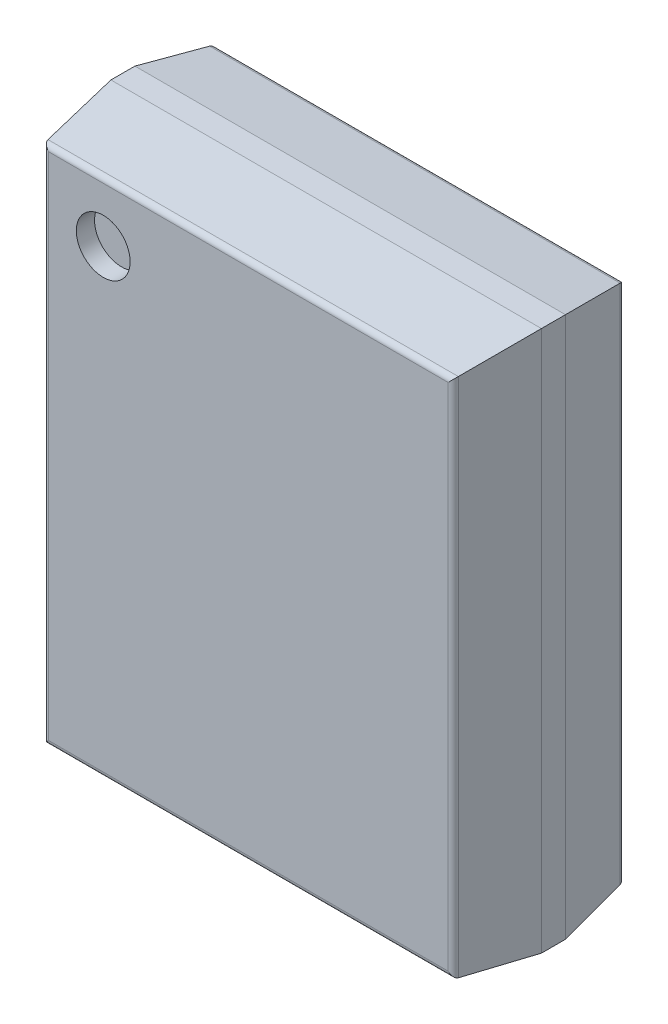
ISO-10303-21;
HEADER;
FILE_DESCRIPTION(('STEP AP214'),'2;1');
FILE_NAME('part.step','',(''),(''),'','','');
FILE_SCHEMA(('AUTOMOTIVE_DESIGN { 1 0 10303 214 1 1 1 1 }'));
ENDSEC;
DATA;
#1=APPLICATION_CONTEXT('core data for automotive mechanical design processes');
#2=APPLICATION_PROTOCOL_DEFINITION('international standard','automotive_design',2000,#1);
#3=PRODUCT_CONTEXT('',#1,'mechanical');
#4=PRODUCT('Part','Part','',(#3));
#5=PRODUCT_RELATED_PRODUCT_CATEGORY('part','',(#4));
#6=PRODUCT_DEFINITION_FORMATION('','',#4);
#7=PRODUCT_DEFINITION_CONTEXT('part definition',#1,'design');
#8=PRODUCT_DEFINITION('design','',#6,#7);
#9=PRODUCT_DEFINITION_SHAPE('','',#8);
#10=(LENGTH_UNIT() NAMED_UNIT(*) SI_UNIT(.MILLI.,.METRE.));
#11=(NAMED_UNIT(*) PLANE_ANGLE_UNIT() SI_UNIT($,.RADIAN.));
#12=(NAMED_UNIT(*) SI_UNIT($,.STERADIAN.) SOLID_ANGLE_UNIT());
#13=UNCERTAINTY_MEASURE_WITH_UNIT(LENGTH_MEASURE(1.E-05),#10,'distance_accuracy_value','');
#14=(GEOMETRIC_REPRESENTATION_CONTEXT(3) GLOBAL_UNCERTAINTY_ASSIGNED_CONTEXT((#13)) GLOBAL_UNIT_ASSIGNED_CONTEXT((#10,
#11,#12)) REPRESENTATION_CONTEXT('',''));
#15=CARTESIAN_POINT('',(0.,0.,0.));
#16=DIRECTION('',(0.,0.,1.));
#17=DIRECTION('',(1.,0.,0.));
#18=AXIS2_PLACEMENT_3D('',#15,#16,#17);
#19=CARTESIAN_POINT('',(-1.315,1.815,1.485));
#20=DIRECTION('',(0.,0.,1.));
#21=DIRECTION('',(1.,0.,0.));
#22=AXIS2_PLACEMENT_3D('',#19,#20,#21);
#23=PLANE('',#22);
#24=CARTESIAN_POINT('',(-1.315,1.815,1.485));
#25=DIRECTION('',(0.,0.,1.));
#26=DIRECTION('',(1.,0.,0.));
#27=AXIS2_PLACEMENT_3D('',#24,#25,#26);
#28=CIRCLE('',#27,0.24375);
#29=CARTESIAN_POINT('',(-1.07125,1.815,1.485));
#30=VERTEX_POINT('',#29);
#31=EDGE_CURVE('E11',#30,#30,#28,.T.);
#32=ORIENTED_EDGE('',*,*,#31,.T.);
#33=EDGE_LOOP('',(#32));
#34=FACE_BOUND('',#33,.T.);
#35=ADVANCED_FACE('F17',(#34),#23,.T.);
#36=CARTESIAN_POINT('',(-1.315,1.815,1.485));
#37=DIRECTION('',(0.,0.,1.));
#38=DIRECTION('',(1.,0.,0.));
#39=AXIS2_PLACEMENT_3D('',#36,#37,#38);
#40=CYLINDRICAL_SURFACE('',#39,0.24375);
#41=DIRECTION('',(0.,0.,1.));
#42=VECTOR('',#41,1.);
#43=CARTESIAN_POINT('',(-1.07125,1.815,1.485));
#44=LINE('',#43,#42);
#45=CARTESIAN_POINT('',(-1.07125,1.815,1.65));
#46=VERTEX_POINT('',#45);
#47=EDGE_CURVE('E20',#30,#46,#44,.T.);
#48=ORIENTED_EDGE('',*,*,#47,.T.);
#49=CARTESIAN_POINT('',(-1.315,1.815,1.65));
#50=DIRECTION('',(0.,0.,1.));
#51=DIRECTION('',(1.,0.,0.));
#52=AXIS2_PLACEMENT_3D('',#49,#50,#51);
#53=CIRCLE('',#52,0.24375);
#54=EDGE_CURVE('E200',#46,#46,#53,.T.);
#55=ORIENTED_EDGE('',*,*,#54,.T.);
#56=ORIENTED_EDGE('',*,*,#47,.F.);
#57=ORIENTED_EDGE('',*,*,#31,.F.);
#58=EDGE_LOOP('',(#48,#55,#56,#57));
#59=FACE_BOUND('',#58,.T.);
#60=ADVANCED_FACE('F468',(#59),#40,.F.);
#61=CARTESIAN_POINT('',(1.808944484583,-2.3525,1.6));
#62=DIRECTION('',(0.,1.,0.));
#63=DIRECTION('',(0.,0.,1.));
#64=AXIS2_PLACEMENT_3D('',#61,#62,#63);
#65=CYLINDRICAL_SURFACE('',#64,0.05);
#66=CARTESIAN_POINT('',(1.808944484583,-2.308944484583,1.6));
#67=DIRECTION('',(-0.707106781186548,-0.707106781186548,0.));
#68=DIRECTION('',(0.707106781186548,-0.707106781186548,0.));
#69=AXIS2_PLACEMENT_3D('',#66,#67,#68);
#70=ELLIPSE('',#69,0.07071067811865,0.05);
#71=CARTESIAN_POINT('',(1.85847222397,-2.35847222397,1.606855875671));
#72=VERTEX_POINT('',#71);
#73=CARTESIAN_POINT('',(1.808944484583,-2.308944484583,1.65));
#74=VERTEX_POINT('',#73);
#75=EDGE_CURVE('E298',#72,#74,#70,.T.);
#76=ORIENTED_EDGE('',*,*,#75,.F.);
#77=DIRECTION('',(0.,1.,0.));
#78=VECTOR('',#77,1.);
#79=CARTESIAN_POINT('',(1.85847222397,-2.3525,1.606855875671));
#80=LINE('',#79,#78);
#81=CARTESIAN_POINT('',(1.85847222397,2.35847222397,1.606855875671));
#82=VERTEX_POINT('',#81);
#83=EDGE_CURVE('E294',#72,#82,#80,.T.);
#84=ORIENTED_EDGE('',*,*,#83,.T.);
#85=CARTESIAN_POINT('',(1.808944484583,2.308944484583,1.6));
#86=DIRECTION('',(-0.707106781186548,0.707106781186548,0.));
#87=DIRECTION('',(0.707106781186548,0.707106781186548,0.));
#88=AXIS2_PLACEMENT_3D('',#85,#86,#87);
#89=ELLIPSE('',#88,0.07071067811865,0.05);
#90=CARTESIAN_POINT('',(1.808944484583,2.308944484583,1.65));
#91=VERTEX_POINT('',#90);
#92=EDGE_CURVE('E203',#91,#82,#89,.T.);
#93=ORIENTED_EDGE('',*,*,#92,.F.);
#94=DIRECTION('',(0.,1.,0.));
#95=VECTOR('',#94,1.);
#96=CARTESIAN_POINT('',(1.808944484583,-2.3525,1.65));
#97=LINE('',#96,#95);
#98=EDGE_CURVE('E306',#74,#91,#97,.T.);
#99=ORIENTED_EDGE('',*,*,#98,.F.);
#100=EDGE_LOOP('',(#76,#84,#93,#99));
#101=FACE_BOUND('',#100,.T.);
#102=ADVANCED_FACE('F320',(#101),#65,.T.);
#103=CARTESIAN_POINT('',(-1.8525,2.308944484583,1.6));
#104=DIRECTION('',(1.,0.,0.));
#105=DIRECTION('',(0.,0.,1.));
#106=AXIS2_PLACEMENT_3D('',#103,#104,#105);
#107=CYLINDRICAL_SURFACE('',#106,0.05);
#108=DIRECTION('',(1.,0.,0.));
#109=VECTOR('',#108,1.);
#110=CARTESIAN_POINT('',(-1.8525,2.308944484583,1.65));
#111=LINE('',#110,#109);
#112=CARTESIAN_POINT('',(-1.808944484583,2.308944484583,1.65));
#113=VERTEX_POINT('',#112);
#114=EDGE_CURVE('E204',#113,#91,#111,.T.);
#115=ORIENTED_EDGE('',*,*,#114,.T.);
#116=ORIENTED_EDGE('',*,*,#92,.T.);
#117=DIRECTION('',(1.,0.,0.));
#118=VECTOR('',#117,1.);
#119=CARTESIAN_POINT('',(-1.8525,2.35847222397,1.606855875671));
#120=LINE('',#119,#118);
#121=CARTESIAN_POINT('',(-1.85847222397,2.35847222397,1.606855875671));
#122=VERTEX_POINT('',#121);
#123=EDGE_CURVE('E289',#122,#82,#120,.T.);
#124=ORIENTED_EDGE('',*,*,#123,.F.);
#125=CARTESIAN_POINT('',(-1.808944484583,2.308944484583,1.6));
#126=DIRECTION('',(0.707106781186548,0.707106781186548,0.));
#127=DIRECTION('',(-0.707106781186548,0.707106781186548,0.));
#128=AXIS2_PLACEMENT_3D('',#125,#126,#127);
#129=ELLIPSE('',#128,0.07071067811865,0.05);
#130=EDGE_CURVE('E284',#122,#113,#129,.T.);
#131=ORIENTED_EDGE('',*,*,#130,.T.);
#132=EDGE_LOOP('',(#115,#116,#124,#131));
#133=FACE_BOUND('',#132,.T.);
#134=ADVANCED_FACE('F314',(#133),#107,.T.);
#135=CARTESIAN_POINT('',(-1.95,-2.45,1.65));
#136=DIRECTION('',(0.,0.,1.));
#137=DIRECTION('',(1.,0.,0.));
#138=AXIS2_PLACEMENT_3D('',#135,#136,#137);
#139=PLANE('',#138);
#140=ORIENTED_EDGE('',*,*,#54,.F.);
#141=EDGE_LOOP('',(#140));
#142=FACE_BOUND('',#141,.T.);
#143=DIRECTION('',(0.,1.,0.));
#144=VECTOR('',#143,1.);
#145=CARTESIAN_POINT('',(-1.808944484583,-2.3525,1.65));
#146=LINE('',#145,#144);
#147=CARTESIAN_POINT('',(-1.808944484583,-2.308944484583,1.65));
#148=VERTEX_POINT('',#147);
#149=EDGE_CURVE('E281',#148,#113,#146,.T.);
#150=ORIENTED_EDGE('',*,*,#149,.F.);
#151=DIRECTION('',(1.,0.,0.));
#152=VECTOR('',#151,1.);
#153=CARTESIAN_POINT('',(-1.8525,-2.308944484583,1.65));
#154=LINE('',#153,#152);
#155=EDGE_CURVE('E302',#148,#74,#154,.T.);
#156=ORIENTED_EDGE('',*,*,#155,.T.);
#157=ORIENTED_EDGE('',*,*,#98,.T.);
#158=ORIENTED_EDGE('',*,*,#114,.F.);
#159=EDGE_LOOP('',(#150,#156,#157,#158));
#160=FACE_BOUND('',#159,.T.);
#161=ADVANCED_FACE('F318',(#142,#160),#139,.T.);
#162=CARTESIAN_POINT('',(-1.8525,-2.308944484583,1.6));
#163=DIRECTION('',(1.,0.,0.));
#164=DIRECTION('',(0.,-0.990554787738321,0.137117513428044));
#165=AXIS2_PLACEMENT_3D('',#162,#163,#164);
#166=CYLINDRICAL_SURFACE('',#165,0.05);
#167=DIRECTION('',(1.,0.,0.));
#168=VECTOR('',#167,1.);
#169=CARTESIAN_POINT('',(-1.8525,-2.35847222397,1.606855875671));
#170=LINE('',#169,#168);
#171=CARTESIAN_POINT('',(-1.85847222397,-2.35847222397,1.606855875671));
#172=VERTEX_POINT('',#171);
#173=EDGE_CURVE('E226',#172,#72,#170,.T.);
#174=ORIENTED_EDGE('',*,*,#173,.T.);
#175=ORIENTED_EDGE('',*,*,#75,.T.);
#176=ORIENTED_EDGE('',*,*,#155,.F.);
#177=CARTESIAN_POINT('',(-1.808944484583,-2.308944484583,1.6));
#178=DIRECTION('',(-0.707106781186548,0.707106781186548,0.));
#179=DIRECTION('',(0.707106781186548,0.707106781186548,0.));
#180=AXIS2_PLACEMENT_3D('',#177,#178,#179);
#181=ELLIPSE('',#180,0.07071067811865,0.05);
#182=EDGE_CURVE('E230',#172,#148,#181,.T.);
#183=ORIENTED_EDGE('',*,*,#182,.F.);
#184=EDGE_LOOP('',(#174,#175,#176,#183));
#185=FACE_BOUND('',#184,.T.);
#186=ADVANCED_FACE('F329',(#185),#166,.T.);
#187=CARTESIAN_POINT('',(1.90125,-2.45,1.297823646339));
#188=DIRECTION('',(0.990554787738321,0.,0.137117513428044));
#189=DIRECTION('',(0.,-1.,0.));
#190=AXIS2_PLACEMENT_3D('',#187,#188,#189);
#191=PLANE('',#190);
#192=DIRECTION('',(-0.135846421408054,0.135846421408054,0.98137225331739));
#193=VECTOR('',#192,1.);
#194=CARTESIAN_POINT('',(1.86616385679,-2.36616385679,1.551290517721));
#195=LINE('',#194,#193);
#196=CARTESIAN_POINT('',(1.95,-2.45,0.945647292679));
#197=VERTEX_POINT('',#196);
#198=EDGE_CURVE('E231',#197,#72,#195,.T.);
#199=ORIENTED_EDGE('',*,*,#198,.F.);
#200=DIRECTION('',(0.,1.,0.));
#201=VECTOR('',#200,1.);
#202=CARTESIAN_POINT('',(1.95,-2.45,0.945647292679));
#203=LINE('',#202,#201);
#204=CARTESIAN_POINT('',(1.95,2.45,0.945647292679));
#205=VERTEX_POINT('',#204);
#206=EDGE_CURVE('E154',#197,#205,#203,.T.);
#207=ORIENTED_EDGE('',*,*,#206,.T.);
#208=DIRECTION('',(-0.135846421408054,-0.135846421408054,0.98137225331739));
#209=VECTOR('',#208,1.);
#210=CARTESIAN_POINT('',(1.820950943777,2.320950943777,1.877914493992));
#211=LINE('',#210,#209);
#212=EDGE_CURVE('E148',#205,#82,#211,.T.);
#213=ORIENTED_EDGE('',*,*,#212,.T.);
#214=ORIENTED_EDGE('',*,*,#83,.F.);
#215=EDGE_LOOP('',(#199,#207,#213,#214));
#216=FACE_BOUND('',#215,.T.);
#217=ADVANCED_FACE('F323',(#216),#191,.T.);
#218=CARTESIAN_POINT('',(-1.95,2.40125,1.297823646339));
#219=DIRECTION('',(0.,0.990554787738321,0.137117513428044));
#220=DIRECTION('',(1.,0.,0.));
#221=AXIS2_PLACEMENT_3D('',#218,#219,#220);
#222=PLANE('',#221);
#223=ORIENTED_EDGE('',*,*,#123,.T.);
#224=ORIENTED_EDGE('',*,*,#212,.F.);
#225=DIRECTION('',(1.,0.,0.));
#226=VECTOR('',#225,1.);
#227=CARTESIAN_POINT('',(-1.95,2.45,0.945647292679));
#228=LINE('',#227,#226);
#229=CARTESIAN_POINT('',(-1.95,2.45,0.945647292679));
#230=VERTEX_POINT('',#229);
#231=EDGE_CURVE('E141',#230,#205,#228,.T.);
#232=ORIENTED_EDGE('',*,*,#231,.F.);
#233=DIRECTION('',(0.135846421408054,-0.135846421408054,0.98137225331739));
#234=VECTOR('',#233,1.);
#235=CARTESIAN_POINT('',(-1.856936731685,2.356936731685,1.617948472062));
#236=LINE('',#235,#234);
#237=EDGE_CURVE('E145',#230,#122,#236,.T.);
#238=ORIENTED_EDGE('',*,*,#237,.T.);
#239=EDGE_LOOP('',(#223,#224,#232,#238));
#240=FACE_BOUND('',#239,.T.);
#241=ADVANCED_FACE('F144',(#240),#222,.T.);
#242=CARTESIAN_POINT('',(-1.808944484583,-2.3525,1.6));
#243=DIRECTION('',(0.,1.,0.));
#244=DIRECTION('',(-0.990554787738321,0.,0.137117513428044));
#245=AXIS2_PLACEMENT_3D('',#242,#243,#244);
#246=CYLINDRICAL_SURFACE('',#245,0.05);
#247=ORIENTED_EDGE('',*,*,#182,.T.);
#248=ORIENTED_EDGE('',*,*,#149,.T.);
#249=ORIENTED_EDGE('',*,*,#130,.F.);
#250=DIRECTION('',(0.,1.,0.));
#251=VECTOR('',#250,1.);
#252=CARTESIAN_POINT('',(-1.85847222397,-2.3525,1.606855875671));
#253=LINE('',#252,#251);
#254=EDGE_CURVE('E164',#172,#122,#253,.T.);
#255=ORIENTED_EDGE('',*,*,#254,.F.);
#256=EDGE_LOOP('',(#247,#248,#249,#255));
#257=FACE_BOUND('',#256,.T.);
#258=ADVANCED_FACE('F326',(#257),#246,.T.);
#259=CARTESIAN_POINT('',(-1.95,-2.40125,1.297823646339));
#260=DIRECTION('',(0.,0.990554787738321,-0.137117513428044));
#261=DIRECTION('',(-1.,0.,0.));
#262=AXIS2_PLACEMENT_3D('',#259,#260,#261);
#263=PLANE('',#262);
#264=DIRECTION('',(0.135846421408054,0.135846421408054,0.98137225331739));
#265=VECTOR('',#264,1.);
#266=CARTESIAN_POINT('',(-1.902149644698,-2.402149644698,1.291324495791));
#267=LINE('',#266,#265);
#268=CARTESIAN_POINT('',(-1.95,-2.45,0.945647292679));
#269=VERTEX_POINT('',#268);
#270=EDGE_CURVE('E166',#269,#172,#267,.T.);
#271=ORIENTED_EDGE('',*,*,#270,.F.);
#272=DIRECTION('',(1.,0.,0.));
#273=VECTOR('',#272,1.);
#274=CARTESIAN_POINT('',(-1.95,-2.45,0.945647292679));
#275=LINE('',#274,#273);
#276=EDGE_CURVE('E255',#269,#197,#275,.T.);
#277=ORIENTED_EDGE('',*,*,#276,.T.);
#278=ORIENTED_EDGE('',*,*,#198,.T.);
#279=ORIENTED_EDGE('',*,*,#173,.F.);
#280=EDGE_LOOP('',(#271,#277,#278,#279));
#281=FACE_BOUND('',#280,.T.);
#282=ADVANCED_FACE('F331',(#281),#263,.F.);
#283=CARTESIAN_POINT('',(1.95,-2.45,0.1));
#284=DIRECTION('',(1.,0.,0.));
#285=DIRECTION('',(0.,1.,0.));
#286=AXIS2_PLACEMENT_3D('',#283,#284,#285);
#287=PLANE('',#286);
#288=DIRECTION('',(0.,0.,1.));
#289=VECTOR('',#288,1.);
#290=CARTESIAN_POINT('',(1.95,-2.45,0.1));
#291=LINE('',#290,#289);
#292=CARTESIAN_POINT('',(1.95,-2.45,0.728147292679));
#293=VERTEX_POINT('',#292);
#294=EDGE_CURVE('E219',#293,#197,#291,.T.);
#295=ORIENTED_EDGE('',*,*,#294,.F.);
#296=DIRECTION('',(0.,1.,0.));
#297=VECTOR('',#296,1.);
#298=CARTESIAN_POINT('',(1.95,-2.45,0.728147292679));
#299=LINE('',#298,#297);
#300=CARTESIAN_POINT('',(1.95,2.45,0.728147292679));
#301=VERTEX_POINT('',#300);
#302=EDGE_CURVE('E218',#293,#301,#299,.T.);
#303=ORIENTED_EDGE('',*,*,#302,.T.);
#304=DIRECTION('',(0.,0.,1.));
#305=VECTOR('',#304,1.);
#306=CARTESIAN_POINT('',(1.95,2.45,0.1));
#307=LINE('',#306,#305);
#308=EDGE_CURVE('E155',#301,#205,#307,.T.);
#309=ORIENTED_EDGE('',*,*,#308,.T.);
#310=ORIENTED_EDGE('',*,*,#206,.F.);
#311=EDGE_LOOP('',(#295,#303,#309,#310));
#312=FACE_BOUND('',#311,.T.);
#313=ADVANCED_FACE('F336',(#312),#287,.T.);
#314=CARTESIAN_POINT('',(1.809662184836,-2.3525,0.15));
#315=DIRECTION('',(0.,1.,0.));
#316=DIRECTION('',(0.,0.,-1.));
#317=AXIS2_PLACEMENT_3D('',#314,#315,#316);
#318=CYLINDRICAL_SURFACE('',#317,0.05);
#319=DIRECTION('',(0.,1.,0.));
#320=VECTOR('',#319,1.);
#321=CARTESIAN_POINT('',(1.809662184836,-2.3525,0.1));
#322=LINE('',#321,#320);
#323=CARTESIAN_POINT('',(1.809662184836,-2.309662184836,0.1));
#324=VERTEX_POINT('',#323);
#325=CARTESIAN_POINT('',(1.809662184836,2.309662184836,0.1));
#326=VERTEX_POINT('',#325);
#327=EDGE_CURVE('E263',#324,#326,#322,.T.);
#328=ORIENTED_EDGE('',*,*,#327,.T.);
#329=CARTESIAN_POINT('',(1.809662184836,2.309662184836,0.15));
#330=DIRECTION('',(0.707106781186548,-0.707106781186548,0.));
#331=DIRECTION('',(0.707106781186548,0.707106781186548,0.));
#332=AXIS2_PLACEMENT_3D('',#329,#330,#331);
#333=ELLIPSE('',#332,0.07071067811865,0.05);
#334=CARTESIAN_POINT('',(1.859070535888,2.359070535888,0.142330916198));
#335=VERTEX_POINT('',#334);
#336=EDGE_CURVE('E237',#326,#335,#333,.T.);
#337=ORIENTED_EDGE('',*,*,#336,.T.);
#338=DIRECTION('',(0.,1.,0.));
#339=VECTOR('',#338,1.);
#340=CARTESIAN_POINT('',(1.859070535888,-2.3525,0.142330916198));
#341=LINE('',#340,#339);
#342=CARTESIAN_POINT('',(1.859070535888,-2.359070535888,0.142330916198));
#343=VERTEX_POINT('',#342);
#344=EDGE_CURVE('E214',#343,#335,#341,.T.);
#345=ORIENTED_EDGE('',*,*,#344,.F.);
#346=CARTESIAN_POINT('',(1.809662184836,-2.309662184836,0.15));
#347=DIRECTION('',(0.707106781186548,0.707106781186548,0.));
#348=DIRECTION('',(0.707106781186548,-0.707106781186548,0.));
#349=AXIS2_PLACEMENT_3D('',#346,#347,#348);
#350=ELLIPSE('',#349,0.07071067811865,0.05);
#351=EDGE_CURVE('E249',#343,#324,#350,.T.);
#352=ORIENTED_EDGE('',*,*,#351,.T.);
#353=EDGE_LOOP('',(#328,#337,#345,#352));
#354=FACE_BOUND('',#353,.T.);
#355=ADVANCED_FACE('F453',(#354),#318,.T.);
#356=CARTESIAN_POINT('',(-1.95,2.45,0.1));
#357=DIRECTION('',(0.,1.,0.));
#358=DIRECTION('',(1.,0.,0.));
#359=AXIS2_PLACEMENT_3D('',#356,#357,#358);
#360=PLANE('',#359);
#361=ORIENTED_EDGE('',*,*,#308,.F.);
#362=DIRECTION('',(1.,0.,0.));
#363=VECTOR('',#362,1.);
#364=CARTESIAN_POINT('',(-1.95,2.45,0.728147292679));
#365=LINE('',#364,#363);
#366=CARTESIAN_POINT('',(-1.95,2.45,0.728147292679));
#367=VERTEX_POINT('',#366);
#368=EDGE_CURVE('E172',#367,#301,#365,.T.);
#369=ORIENTED_EDGE('',*,*,#368,.F.);
#370=DIRECTION('',(0.,0.,1.));
#371=VECTOR('',#370,1.);
#372=CARTESIAN_POINT('',(-1.95,2.45,0.1));
#373=LINE('',#372,#371);
#374=EDGE_CURVE('E169',#367,#230,#373,.T.);
#375=ORIENTED_EDGE('',*,*,#374,.T.);
#376=ORIENTED_EDGE('',*,*,#231,.T.);
#377=EDGE_LOOP('',(#361,#369,#375,#376));
#378=FACE_BOUND('',#377,.T.);
#379=ADVANCED_FACE('F170',(#378),#360,.T.);
#380=CARTESIAN_POINT('',(-1.90125,-2.45,1.297823646339));
#381=DIRECTION('',(0.990554787738321,0.,-0.137117513428044));
#382=DIRECTION('',(0.,-1.,0.));
#383=AXIS2_PLACEMENT_3D('',#380,#381,#382);
#384=PLANE('',#383);
#385=ORIENTED_EDGE('',*,*,#254,.T.);
#386=ORIENTED_EDGE('',*,*,#237,.F.);
#387=DIRECTION('',(0.,1.,0.));
#388=VECTOR('',#387,1.);
#389=CARTESIAN_POINT('',(-1.95,-2.45,0.945647292679));
#390=LINE('',#389,#388);
#391=EDGE_CURVE('E162',#269,#230,#390,.T.);
#392=ORIENTED_EDGE('',*,*,#391,.F.);
#393=ORIENTED_EDGE('',*,*,#270,.T.);
#394=EDGE_LOOP('',(#385,#386,#392,#393));
#395=FACE_BOUND('',#394,.T.);
#396=ADVANCED_FACE('F159',(#395),#384,.F.);
#397=CARTESIAN_POINT('',(-1.8525,2.309662184836,0.15));
#398=DIRECTION('',(1.,0.,0.));
#399=DIRECTION('',(0.,0.,-1.));
#400=AXIS2_PLACEMENT_3D('',#397,#398,#399);
#401=CYLINDRICAL_SURFACE('',#400,0.05);
#402=CARTESIAN_POINT('',(-1.809662184836,2.309662184836,0.15));
#403=DIRECTION('',(-0.707106781186548,-0.707106781186548,0.));
#404=DIRECTION('',(-0.707106781186548,0.707106781186548,0.));
#405=AXIS2_PLACEMENT_3D('',#402,#403,#404);
#406=ELLIPSE('',#405,0.07071067811865,0.05);
#407=CARTESIAN_POINT('',(-1.859070535888,2.359070535888,0.142330916198));
#408=VERTEX_POINT('',#407);
#409=CARTESIAN_POINT('',(-1.809662184836,2.309662184836,0.1));
#410=VERTEX_POINT('',#409);
#411=EDGE_CURVE('E205',#408,#410,#406,.T.);
#412=ORIENTED_EDGE('',*,*,#411,.F.);
#413=DIRECTION('',(1.,0.,0.));
#414=VECTOR('',#413,1.);
#415=CARTESIAN_POINT('',(-1.8525,2.359070535888,0.142330916198));
#416=LINE('',#415,#414);
#417=EDGE_CURVE('E244',#408,#335,#416,.T.);
#418=ORIENTED_EDGE('',*,*,#417,.T.);
#419=ORIENTED_EDGE('',*,*,#336,.F.);
#420=DIRECTION('',(1.,0.,0.));
#421=VECTOR('',#420,1.);
#422=CARTESIAN_POINT('',(-1.8525,2.309662184836,0.1));
#423=LINE('',#422,#421);
#424=EDGE_CURVE('E262',#410,#326,#423,.T.);
#425=ORIENTED_EDGE('',*,*,#424,.F.);
#426=EDGE_LOOP('',(#412,#418,#419,#425));
#427=FACE_BOUND('',#426,.T.);
#428=ADVANCED_FACE('F455',(#427),#401,.T.);
#429=CARTESIAN_POINT('',(-1.95,-2.45,0.1));
#430=DIRECTION('',(0.,0.,1.));
#431=DIRECTION('',(1.,0.,0.));
#432=AXIS2_PLACEMENT_3D('',#429,#430,#431);
#433=PLANE('',#432);
#434=ORIENTED_EDGE('',*,*,#424,.T.);
#435=ORIENTED_EDGE('',*,*,#327,.F.);
#436=DIRECTION('',(1.,0.,0.));
#437=VECTOR('',#436,1.);
#438=CARTESIAN_POINT('',(-1.8525,-2.309662184836,0.1));
#439=LINE('',#438,#437);
#440=CARTESIAN_POINT('',(-1.809662184836,-2.309662184836,0.1));
#441=VERTEX_POINT('',#440);
#442=EDGE_CURVE('E245',#441,#324,#439,.T.);
#443=ORIENTED_EDGE('',*,*,#442,.F.);
#444=DIRECTION('',(0.,1.,0.));
#445=VECTOR('',#444,1.);
#446=CARTESIAN_POINT('',(-1.809662184836,-2.3525,0.1));
#447=LINE('',#446,#445);
#448=EDGE_CURVE('E189',#441,#410,#447,.T.);
#449=ORIENTED_EDGE('',*,*,#448,.T.);
#450=EDGE_LOOP('',(#434,#435,#443,#449));
#451=FACE_BOUND('',#450,.T.);
#452=ADVANCED_FACE('F457',(#451),#433,.F.);
#453=CARTESIAN_POINT('',(1.90125,-2.45,0.414073646339));
#454=DIRECTION('',(-0.988167021032104,0.,0.153381676039016));
#455=DIRECTION('',(0.,1.,0.));
#456=AXIS2_PLACEMENT_3D('',#453,#454,#455);
#457=PLANE('',#456);
#458=ORIENTED_EDGE('',*,*,#344,.T.);
#459=DIRECTION('',(-0.151608675110006,-0.151608675110006,-0.976744398122036));
#460=VECTOR('',#459,1.);
#461=CARTESIAN_POINT('',(1.801235690409,2.301235690409,-0.230272177239));
#462=LINE('',#461,#460);
#463=EDGE_CURVE('E240',#301,#335,#462,.T.);
#464=ORIENTED_EDGE('',*,*,#463,.F.);
#465=ORIENTED_EDGE('',*,*,#302,.F.);
#466=DIRECTION('',(-0.151608675110006,0.151608675110006,-0.976744398122036));
#467=VECTOR('',#466,1.);
#468=CARTESIAN_POINT('',(1.857549406812,-2.357549406812,0.132530986856));
#469=LINE('',#468,#467);
#470=EDGE_CURVE('E213',#293,#343,#469,.T.);
#471=ORIENTED_EDGE('',*,*,#470,.T.);
#472=EDGE_LOOP('',(#458,#464,#465,#471));
#473=FACE_BOUND('',#472,.T.);
#474=ADVANCED_FACE('F346',(#473),#457,.F.);
#475=CARTESIAN_POINT('',(-1.95,-2.45,0.1));
#476=DIRECTION('',(0.,1.,0.));
#477=DIRECTION('',(1.,0.,0.));
#478=AXIS2_PLACEMENT_3D('',#475,#476,#477);
#479=PLANE('',#478);
#480=ORIENTED_EDGE('',*,*,#276,.F.);
#481=DIRECTION('',(0.,0.,1.));
#482=VECTOR('',#481,1.);
#483=CARTESIAN_POINT('',(-1.95,-2.45,0.1));
#484=LINE('',#483,#482);
#485=CARTESIAN_POINT('',(-1.95,-2.45,0.728147292679));
#486=VERTEX_POINT('',#485);
#487=EDGE_CURVE('E177',#486,#269,#484,.T.);
#488=ORIENTED_EDGE('',*,*,#487,.F.);
#489=DIRECTION('',(1.,0.,0.));
#490=VECTOR('',#489,1.);
#491=CARTESIAN_POINT('',(-1.95,-2.45,0.728147292679));
#492=LINE('',#491,#490);
#493=EDGE_CURVE('E209',#486,#293,#492,.T.);
#494=ORIENTED_EDGE('',*,*,#493,.T.);
#495=ORIENTED_EDGE('',*,*,#294,.T.);
#496=EDGE_LOOP('',(#480,#488,#494,#495));
#497=FACE_BOUND('',#496,.T.);
#498=ADVANCED_FACE('F338',(#497),#479,.F.);
#499=CARTESIAN_POINT('',(-1.8525,-2.309662184836,0.15));
#500=DIRECTION('',(1.,0.,0.));
#501=DIRECTION('',(0.,-0.988167021032104,-0.153381676039016));
#502=AXIS2_PLACEMENT_3D('',#499,#500,#501);
#503=CYLINDRICAL_SURFACE('',#502,0.05);
#504=CARTESIAN_POINT('',(-1.809662184836,-2.309662184836,0.15));
#505=DIRECTION('',(0.707106781186548,-0.707106781186548,0.));
#506=DIRECTION('',(0.707106781186548,0.707106781186548,0.));
#507=AXIS2_PLACEMENT_3D('',#504,#505,#506);
#508=ELLIPSE('',#507,0.07071067811865,0.05);
#509=CARTESIAN_POINT('',(-1.859070535888,-2.359070535888,0.142330916198));
#510=VERTEX_POINT('',#509);
#511=EDGE_CURVE('E182',#510,#441,#508,.T.);
#512=ORIENTED_EDGE('',*,*,#511,.T.);
#513=ORIENTED_EDGE('',*,*,#442,.T.);
#514=ORIENTED_EDGE('',*,*,#351,.F.);
#515=DIRECTION('',(1.,0.,0.));
#516=VECTOR('',#515,1.);
#517=CARTESIAN_POINT('',(-1.8525,-2.359070535888,0.142330916198));
#518=LINE('',#517,#516);
#519=EDGE_CURVE('E199',#510,#343,#518,.T.);
#520=ORIENTED_EDGE('',*,*,#519,.F.);
#521=EDGE_LOOP('',(#512,#513,#514,#520));
#522=FACE_BOUND('',#521,.T.);
#523=ADVANCED_FACE('F451',(#522),#503,.T.);
#524=CARTESIAN_POINT('',(-1.95,2.40125,0.414073646339));
#525=DIRECTION('',(0.,-0.988167021032104,0.153381676039016));
#526=DIRECTION('',(-1.,0.,0.));
#527=AXIS2_PLACEMENT_3D('',#524,#525,#526);
#528=PLANE('',#527);
#529=DIRECTION('',(0.151608675110006,-0.151608675110006,-0.976744398122036));
#530=VECTOR('',#529,1.);
#531=CARTESIAN_POINT('',(-1.846056811627,2.346056811627,0.05848952479572));
#532=LINE('',#531,#530);
#533=EDGE_CURVE('E193',#367,#408,#532,.T.);
#534=ORIENTED_EDGE('',*,*,#533,.F.);
#535=ORIENTED_EDGE('',*,*,#368,.T.);
#536=ORIENTED_EDGE('',*,*,#463,.T.);
#537=ORIENTED_EDGE('',*,*,#417,.F.);
#538=EDGE_LOOP('',(#534,#535,#536,#537));
#539=FACE_BOUND('',#538,.T.);
#540=ADVANCED_FACE('F350',(#539),#528,.F.);
#541=CARTESIAN_POINT('',(-1.95,-2.45,0.1));
#542=DIRECTION('',(1.,0.,0.));
#543=DIRECTION('',(0.,1.,0.));
#544=AXIS2_PLACEMENT_3D('',#541,#542,#543);
#545=PLANE('',#544);
#546=ORIENTED_EDGE('',*,*,#391,.T.);
#547=ORIENTED_EDGE('',*,*,#374,.F.);
#548=DIRECTION('',(0.,1.,0.));
#549=VECTOR('',#548,1.);
#550=CARTESIAN_POINT('',(-1.95,-2.45,0.728147292679));
#551=LINE('',#550,#549);
#552=EDGE_CURVE('E358',#486,#367,#551,.T.);
#553=ORIENTED_EDGE('',*,*,#552,.F.);
#554=ORIENTED_EDGE('',*,*,#487,.T.);
#555=EDGE_LOOP('',(#546,#547,#553,#554));
#556=FACE_BOUND('',#555,.T.);
#557=ADVANCED_FACE('F180',(#556),#545,.F.);
#558=CARTESIAN_POINT('',(-1.809662184836,-2.3525,0.15));
#559=DIRECTION('',(0.,1.,0.));
#560=DIRECTION('',(-0.988167021032104,0.,-0.153381676039016));
#561=AXIS2_PLACEMENT_3D('',#558,#559,#560);
#562=CYLINDRICAL_SURFACE('',#561,0.05);
#563=DIRECTION('',(0.,1.,0.));
#564=VECTOR('',#563,1.);
#565=CARTESIAN_POINT('',(-1.859070535888,-2.3525,0.142330916198));
#566=LINE('',#565,#564);
#567=EDGE_CURVE('E195',#510,#408,#566,.T.);
#568=ORIENTED_EDGE('',*,*,#567,.T.);
#569=ORIENTED_EDGE('',*,*,#411,.T.);
#570=ORIENTED_EDGE('',*,*,#448,.F.);
#571=ORIENTED_EDGE('',*,*,#511,.F.);
#572=EDGE_LOOP('',(#568,#569,#570,#571));
#573=FACE_BOUND('',#572,.T.);
#574=ADVANCED_FACE('F446',(#573),#562,.T.);
#575=CARTESIAN_POINT('',(-1.95,-2.40125,0.414073646339));
#576=DIRECTION('',(0.,-0.988167021032104,-0.153381676039016));
#577=DIRECTION('',(0.,0.153381676039016,-0.988167021032104));
#578=AXIS2_PLACEMENT_3D('',#575,#576,#577);
#579=PLANE('',#578);
#580=ORIENTED_EDGE('',*,*,#519,.T.);
#581=ORIENTED_EDGE('',*,*,#470,.F.);
#582=ORIENTED_EDGE('',*,*,#493,.F.);
#583=DIRECTION('',(0.151608675110006,0.151608675110006,-0.976744398122036));
#584=VECTOR('',#583,1.);
#585=CARTESIAN_POINT('',(-1.90237052803,-2.40237052803,0.42129268889));
#586=LINE('',#585,#584);
#587=EDGE_CURVE('E437',#486,#510,#586,.T.);
#588=ORIENTED_EDGE('',*,*,#587,.T.);
#589=EDGE_LOOP('',(#580,#581,#582,#588));
#590=FACE_BOUND('',#589,.T.);
#591=ADVANCED_FACE('F343',(#590),#579,.T.);
#592=CARTESIAN_POINT('',(-1.90125,-2.45,0.414073646339));
#593=DIRECTION('',(-0.988167021032104,0.,-0.153381676039016));
#594=DIRECTION('',(-0.153381676039016,0.,0.988167021032104));
#595=AXIS2_PLACEMENT_3D('',#592,#593,#594);
#596=PLANE('',#595);
#597=ORIENTED_EDGE('',*,*,#587,.F.);
#598=ORIENTED_EDGE('',*,*,#552,.T.);
#599=ORIENTED_EDGE('',*,*,#533,.T.);
#600=ORIENTED_EDGE('',*,*,#567,.F.);
#601=EDGE_LOOP('',(#597,#598,#599,#600));
#602=FACE_BOUND('',#601,.T.);
#603=ADVANCED_FACE('F444',(#602),#596,.T.);
#604=CLOSED_SHELL('',(#35,#60,#102,#134,#161,#186,#217,#241,#258,#282,#313,#355,#379,#396,#428,
#452,#474,#498,#523,#540,#557,#574,#591,#603));
#605=MANIFOLD_SOLID_BREP('B1',#604);
#606=ADVANCED_BREP_SHAPE_REPRESENTATION('',(#18,#605),#14);
#607=SHAPE_DEFINITION_REPRESENTATION(#9,#606);
ENDSEC;
END-ISO-10303-21;
